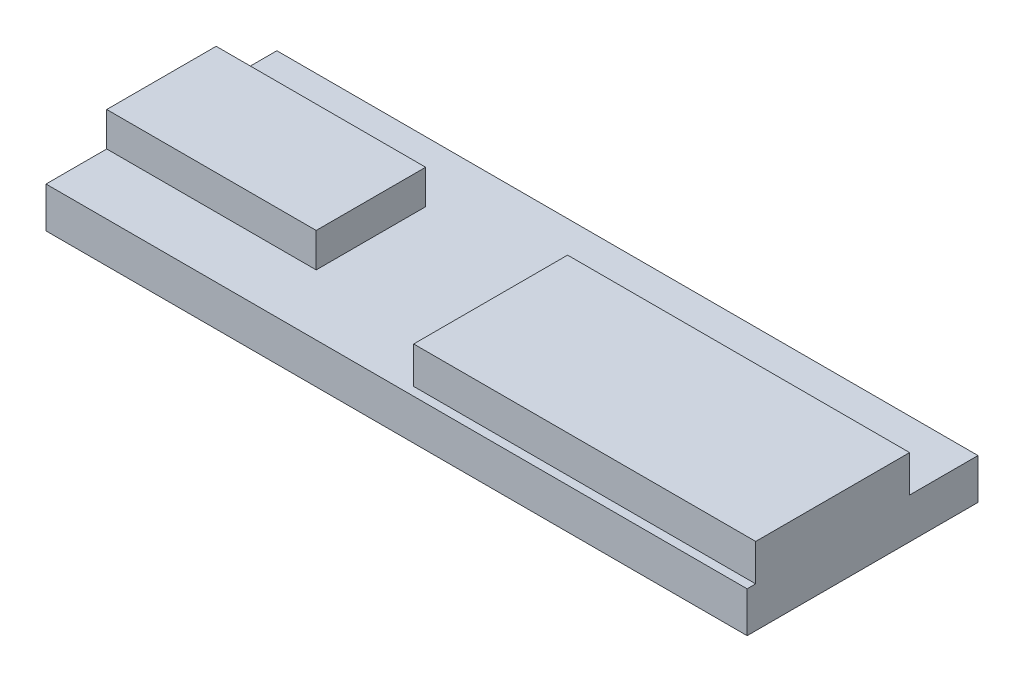
ISO-10303-21;
HEADER;
FILE_DESCRIPTION(('STEP AP214'),'2;1');
FILE_NAME('part.step','',(''),(''),'','','');
FILE_SCHEMA(('AUTOMOTIVE_DESIGN { 1 0 10303 214 1 1 1 1 }'));
ENDSEC;
DATA;
#1=APPLICATION_CONTEXT('core data for automotive mechanical design processes');
#2=APPLICATION_PROTOCOL_DEFINITION('international standard','automotive_design',2000,#1);
#3=PRODUCT_CONTEXT('',#1,'mechanical');
#4=PRODUCT('Part','Part','',(#3));
#5=PRODUCT_RELATED_PRODUCT_CATEGORY('part','',(#4));
#6=PRODUCT_DEFINITION_FORMATION('','',#4);
#7=PRODUCT_DEFINITION_CONTEXT('part definition',#1,'design');
#8=PRODUCT_DEFINITION('design','',#6,#7);
#9=PRODUCT_DEFINITION_SHAPE('','',#8);
#10=(LENGTH_UNIT() NAMED_UNIT(*) SI_UNIT(.MILLI.,.METRE.));
#11=(NAMED_UNIT(*) PLANE_ANGLE_UNIT() SI_UNIT($,.RADIAN.));
#12=(NAMED_UNIT(*) SI_UNIT($,.STERADIAN.) SOLID_ANGLE_UNIT());
#13=UNCERTAINTY_MEASURE_WITH_UNIT(LENGTH_MEASURE(1.E-05),#10,'distance_accuracy_value','');
#14=(GEOMETRIC_REPRESENTATION_CONTEXT(3) GLOBAL_UNCERTAINTY_ASSIGNED_CONTEXT((#13)) GLOBAL_UNIT_ASSIGNED_CONTEXT((#10,
#11,#12)) REPRESENTATION_CONTEXT('',''));
#15=CARTESIAN_POINT('',(0.,0.,0.));
#16=DIRECTION('',(0.,0.,1.));
#17=DIRECTION('',(1.,0.,0.));
#18=AXIS2_PLACEMENT_3D('',#15,#16,#17);
#19=CARTESIAN_POINT('',(0.,9.5,0.));
#20=DIRECTION('',(0.,-1.,0.));
#21=DIRECTION('',(0.,0.,-1.));
#22=AXIS2_PLACEMENT_3D('',#19,#20,#21);
#23=PLANE('',#22);
#24=DIRECTION('',(-1.,0.,0.));
#25=VECTOR('',#24,1.);
#26=CARTESIAN_POINT('',(164.,9.5,-38.));
#27=LINE('',#26,#25);
#28=CARTESIAN_POINT('',(164.,9.5,-38.));
#29=VERTEX_POINT('',#28);
#30=CARTESIAN_POINT('',(84.,9.5,-38.));
#31=VERTEX_POINT('',#30);
#32=EDGE_CURVE('E234',#29,#31,#27,.T.);
#33=ORIENTED_EDGE('',*,*,#32,.F.);
#34=DIRECTION('',(0.,0.,-1.));
#35=VECTOR('',#34,1.);
#36=CARTESIAN_POINT('',(164.,9.5,0.));
#37=LINE('',#36,#35);
#38=CARTESIAN_POINT('',(164.,9.5,-54.));
#39=VERTEX_POINT('',#38);
#40=EDGE_CURVE('E152',#29,#39,#37,.T.);
#41=ORIENTED_EDGE('',*,*,#40,.T.);
#42=DIRECTION('',(1.,0.,0.));
#43=VECTOR('',#42,1.);
#44=CARTESIAN_POINT('',(0.,9.5,-54.));
#45=LINE('',#44,#43);
#46=CARTESIAN_POINT('',(0.,9.5,-54.));
#47=VERTEX_POINT('',#46);
#48=EDGE_CURVE('E192',#47,#39,#45,.T.);
#49=ORIENTED_EDGE('',*,*,#48,.F.);
#50=DIRECTION('',(0.,0.,-1.));
#51=VECTOR('',#50,1.);
#52=CARTESIAN_POINT('',(0.,9.5,0.));
#53=LINE('',#52,#51);
#54=CARTESIAN_POINT('',(0.,9.5,-39.8));
#55=VERTEX_POINT('',#54);
#56=EDGE_CURVE('E193',#55,#47,#53,.T.);
#57=ORIENTED_EDGE('',*,*,#56,.F.);
#58=DIRECTION('',(-1.,0.,0.));
#59=VECTOR('',#58,1.);
#60=CARTESIAN_POINT('',(0.,9.5,-39.8));
#61=LINE('',#60,#59);
#62=CARTESIAN_POINT('',(49.,9.5,-39.8));
#63=VERTEX_POINT('',#62);
#64=EDGE_CURVE('E166',#63,#55,#61,.T.);
#65=ORIENTED_EDGE('',*,*,#64,.F.);
#66=DIRECTION('',(0.,0.,-1.));
#67=VECTOR('',#66,1.);
#68=CARTESIAN_POINT('',(49.,9.5,-14.2));
#69=LINE('',#68,#67);
#70=CARTESIAN_POINT('',(49.,9.5,-14.2));
#71=VERTEX_POINT('',#70);
#72=EDGE_CURVE('E156',#71,#63,#69,.T.);
#73=ORIENTED_EDGE('',*,*,#72,.F.);
#74=DIRECTION('',(1.,0.,0.));
#75=VECTOR('',#74,1.);
#76=CARTESIAN_POINT('',(0.,9.5,-14.2));
#77=LINE('',#76,#75);
#78=CARTESIAN_POINT('',(0.,9.5,-14.2));
#79=VERTEX_POINT('',#78);
#80=EDGE_CURVE('E153',#79,#71,#77,.T.);
#81=ORIENTED_EDGE('',*,*,#80,.F.);
#82=CARTESIAN_POINT('',(0.,9.5,0.));
#83=VERTEX_POINT('',#82);
#84=EDGE_CURVE('E189',#83,#79,#53,.T.);
#85=ORIENTED_EDGE('',*,*,#84,.F.);
#86=DIRECTION('',(1.,0.,0.));
#87=VECTOR('',#86,1.);
#88=CARTESIAN_POINT('',(0.,9.5,0.));
#89=LINE('',#88,#87);
#90=CARTESIAN_POINT('',(164.,9.5,0.));
#91=VERTEX_POINT('',#90);
#92=EDGE_CURVE('E198',#83,#91,#89,.T.);
#93=ORIENTED_EDGE('',*,*,#92,.T.);
#94=CARTESIAN_POINT('',(164.,9.5,-1.99999999999999));
#95=VERTEX_POINT('',#94);
#96=EDGE_CURVE('E196',#91,#95,#37,.T.);
#97=ORIENTED_EDGE('',*,*,#96,.T.);
#98=DIRECTION('',(1.,0.,0.));
#99=VECTOR('',#98,1.);
#100=CARTESIAN_POINT('',(164.,9.5,-2.));
#101=LINE('',#100,#99);
#102=CARTESIAN_POINT('',(84.,9.5,-1.99999999999999));
#103=VERTEX_POINT('',#102);
#104=EDGE_CURVE('E62',#103,#95,#101,.T.);
#105=ORIENTED_EDGE('',*,*,#104,.F.);
#106=DIRECTION('',(0.,0.,1.));
#107=VECTOR('',#106,1.);
#108=CARTESIAN_POINT('',(84.,9.5,-1.99999999999999));
#109=LINE('',#108,#107);
#110=EDGE_CURVE('E57',#31,#103,#109,.T.);
#111=ORIENTED_EDGE('',*,*,#110,.F.);
#112=EDGE_LOOP('',(#33,#41,#49,#57,#65,#73,#81,#85,#93,#97,#105,#111));
#113=FACE_BOUND('',#112,.T.);
#114=ADVANCED_FACE('F40',(#113),#23,.F.);
#115=CARTESIAN_POINT('',(0.,9.5,0.));
#116=DIRECTION('',(-1.,0.,0.));
#117=DIRECTION('',(0.,0.,1.));
#118=AXIS2_PLACEMENT_3D('',#115,#116,#117);
#119=PLANE('',#118);
#120=DIRECTION('',(0.,0.,-1.));
#121=VECTOR('',#120,1.);
#122=CARTESIAN_POINT('',(0.,0.,0.));
#123=LINE('',#122,#121);
#124=CARTESIAN_POINT('',(0.,0.,0.));
#125=VERTEX_POINT('',#124);
#126=CARTESIAN_POINT('',(0.,0.,-54.));
#127=VERTEX_POINT('',#126);
#128=EDGE_CURVE('E188',#125,#127,#123,.T.);
#129=ORIENTED_EDGE('',*,*,#128,.F.);
#130=DIRECTION('',(0.,-1.,0.));
#131=VECTOR('',#130,1.);
#132=CARTESIAN_POINT('',(0.,9.5,0.));
#133=LINE('',#132,#131);
#134=EDGE_CURVE('E11',#83,#125,#133,.T.);
#135=ORIENTED_EDGE('',*,*,#134,.F.);
#136=ORIENTED_EDGE('',*,*,#84,.T.);
#137=DIRECTION('',(0.,-1.,0.));
#138=VECTOR('',#137,1.);
#139=CARTESIAN_POINT('',(0.,17.5,-14.2));
#140=LINE('',#139,#138);
#141=CARTESIAN_POINT('',(0.,17.5,-14.2));
#142=VERTEX_POINT('',#141);
#143=EDGE_CURVE('E185',#142,#79,#140,.T.);
#144=ORIENTED_EDGE('',*,*,#143,.F.);
#145=DIRECTION('',(0.,0.,1.));
#146=VECTOR('',#145,1.);
#147=CARTESIAN_POINT('',(0.,17.5,-14.2));
#148=LINE('',#147,#146);
#149=CARTESIAN_POINT('',(0.,17.5,-39.8));
#150=VERTEX_POINT('',#149);
#151=EDGE_CURVE('E162',#150,#142,#148,.T.);
#152=ORIENTED_EDGE('',*,*,#151,.F.);
#153=DIRECTION('',(0.,-1.,0.));
#154=VECTOR('',#153,1.);
#155=CARTESIAN_POINT('',(0.,17.5,-39.8));
#156=LINE('',#155,#154);
#157=EDGE_CURVE('E171',#150,#55,#156,.T.);
#158=ORIENTED_EDGE('',*,*,#157,.T.);
#159=ORIENTED_EDGE('',*,*,#56,.T.);
#160=DIRECTION('',(0.,-1.,0.));
#161=VECTOR('',#160,1.);
#162=CARTESIAN_POINT('',(0.,9.5,-54.));
#163=LINE('',#162,#161);
#164=EDGE_CURVE('E44',#47,#127,#163,.T.);
#165=ORIENTED_EDGE('',*,*,#164,.T.);
#166=EDGE_LOOP('',(#129,#135,#136,#144,#152,#158,#159,#165));
#167=FACE_BOUND('',#166,.T.);
#168=ADVANCED_FACE('F42',(#167),#119,.T.);
#169=CARTESIAN_POINT('',(0.,9.5,0.));
#170=DIRECTION('',(0.,0.,-1.));
#171=DIRECTION('',(-1.,0.,0.));
#172=AXIS2_PLACEMENT_3D('',#169,#170,#171);
#173=PLANE('',#172);
#174=DIRECTION('',(1.,0.,0.));
#175=VECTOR('',#174,1.);
#176=CARTESIAN_POINT('',(0.,0.,0.));
#177=LINE('',#176,#175);
#178=CARTESIAN_POINT('',(164.,0.,0.));
#179=VERTEX_POINT('',#178);
#180=EDGE_CURVE('E207',#125,#179,#177,.T.);
#181=ORIENTED_EDGE('',*,*,#180,.T.);
#182=DIRECTION('',(0.,-1.,0.));
#183=VECTOR('',#182,1.);
#184=CARTESIAN_POINT('',(164.,9.5,0.));
#185=LINE('',#184,#183);
#186=EDGE_CURVE('E49',#91,#179,#185,.T.);
#187=ORIENTED_EDGE('',*,*,#186,.F.);
#188=ORIENTED_EDGE('',*,*,#92,.F.);
#189=ORIENTED_EDGE('',*,*,#134,.T.);
#190=EDGE_LOOP('',(#181,#187,#188,#189));
#191=FACE_BOUND('',#190,.T.);
#192=ADVANCED_FACE('F224',(#191),#173,.F.);
#193=CARTESIAN_POINT('',(164.,9.5,0.));
#194=DIRECTION('',(-1.,0.,0.));
#195=DIRECTION('',(0.,0.,1.));
#196=AXIS2_PLACEMENT_3D('',#193,#194,#195);
#197=PLANE('',#196);
#198=DIRECTION('',(0.,0.,-1.));
#199=VECTOR('',#198,1.);
#200=CARTESIAN_POINT('',(164.,0.,0.));
#201=LINE('',#200,#199);
#202=CARTESIAN_POINT('',(164.,0.,-54.));
#203=VERTEX_POINT('',#202);
#204=EDGE_CURVE('E205',#179,#203,#201,.T.);
#205=ORIENTED_EDGE('',*,*,#204,.T.);
#206=DIRECTION('',(0.,-1.,0.));
#207=VECTOR('',#206,1.);
#208=CARTESIAN_POINT('',(164.,9.5,-54.));
#209=LINE('',#208,#207);
#210=EDGE_CURVE('E210',#39,#203,#209,.T.);
#211=ORIENTED_EDGE('',*,*,#210,.F.);
#212=ORIENTED_EDGE('',*,*,#40,.F.);
#213=DIRECTION('',(0.,-1.,0.));
#214=VECTOR('',#213,1.);
#215=CARTESIAN_POINT('',(164.,18.1,-38.));
#216=LINE('',#215,#214);
#217=CARTESIAN_POINT('',(164.,18.1,-38.));
#218=VERTEX_POINT('',#217);
#219=EDGE_CURVE('E133',#218,#29,#216,.T.);
#220=ORIENTED_EDGE('',*,*,#219,.F.);
#221=DIRECTION('',(0.,0.,-1.));
#222=VECTOR('',#221,1.);
#223=CARTESIAN_POINT('',(164.,18.1,-2.));
#224=LINE('',#223,#222);
#225=CARTESIAN_POINT('',(164.,18.1,-2.));
#226=VERTEX_POINT('',#225);
#227=EDGE_CURVE('E139',#226,#218,#224,.T.);
#228=ORIENTED_EDGE('',*,*,#227,.F.);
#229=DIRECTION('',(0.,-1.,0.));
#230=VECTOR('',#229,1.);
#231=CARTESIAN_POINT('',(164.,18.1,-2.));
#232=LINE('',#231,#230);
#233=EDGE_CURVE('E227',#226,#95,#232,.T.);
#234=ORIENTED_EDGE('',*,*,#233,.T.);
#235=ORIENTED_EDGE('',*,*,#96,.F.);
#236=ORIENTED_EDGE('',*,*,#186,.T.);
#237=EDGE_LOOP('',(#205,#211,#212,#220,#228,#234,#235,#236));
#238=FACE_BOUND('',#237,.T.);
#239=ADVANCED_FACE('F150',(#238),#197,.F.);
#240=CARTESIAN_POINT('',(0.,9.5,-54.));
#241=DIRECTION('',(0.,0.,-1.));
#242=DIRECTION('',(-1.,0.,0.));
#243=AXIS2_PLACEMENT_3D('',#240,#241,#242);
#244=PLANE('',#243);
#245=DIRECTION('',(1.,0.,0.));
#246=VECTOR('',#245,1.);
#247=CARTESIAN_POINT('',(0.,0.,-54.));
#248=LINE('',#247,#246);
#249=EDGE_CURVE('E202',#127,#203,#248,.T.);
#250=ORIENTED_EDGE('',*,*,#249,.F.);
#251=ORIENTED_EDGE('',*,*,#164,.F.);
#252=ORIENTED_EDGE('',*,*,#48,.T.);
#253=ORIENTED_EDGE('',*,*,#210,.T.);
#254=EDGE_LOOP('',(#250,#251,#252,#253));
#255=FACE_BOUND('',#254,.T.);
#256=ADVANCED_FACE('F217',(#255),#244,.T.);
#257=CARTESIAN_POINT('',(0.,0.,0.));
#258=DIRECTION('',(0.,-1.,0.));
#259=DIRECTION('',(0.,0.,-1.));
#260=AXIS2_PLACEMENT_3D('',#257,#258,#259);
#261=PLANE('',#260);
#262=ORIENTED_EDGE('',*,*,#128,.T.);
#263=ORIENTED_EDGE('',*,*,#249,.T.);
#264=ORIENTED_EDGE('',*,*,#204,.F.);
#265=ORIENTED_EDGE('',*,*,#180,.F.);
#266=EDGE_LOOP('',(#262,#263,#264,#265));
#267=FACE_BOUND('',#266,.T.);
#268=ADVANCED_FACE('F221',(#267),#261,.T.);
#269=CARTESIAN_POINT('',(0.,17.5,-14.2));
#270=DIRECTION('',(0.,0.,-1.));
#271=DIRECTION('',(-1.,0.,0.));
#272=AXIS2_PLACEMENT_3D('',#269,#270,#271);
#273=PLANE('',#272);
#274=ORIENTED_EDGE('',*,*,#80,.T.);
#275=DIRECTION('',(0.,-1.,0.));
#276=VECTOR('',#275,1.);
#277=CARTESIAN_POINT('',(49.,17.5,-14.2));
#278=LINE('',#277,#276);
#279=CARTESIAN_POINT('',(49.,17.5,-14.2));
#280=VERTEX_POINT('',#279);
#281=EDGE_CURVE('E182',#280,#71,#278,.T.);
#282=ORIENTED_EDGE('',*,*,#281,.F.);
#283=DIRECTION('',(1.,0.,0.));
#284=VECTOR('',#283,1.);
#285=CARTESIAN_POINT('',(0.,17.5,-14.2));
#286=LINE('',#285,#284);
#287=EDGE_CURVE('E165',#142,#280,#286,.T.);
#288=ORIENTED_EDGE('',*,*,#287,.F.);
#289=ORIENTED_EDGE('',*,*,#143,.T.);
#290=EDGE_LOOP('',(#274,#282,#288,#289));
#291=FACE_BOUND('',#290,.T.);
#292=ADVANCED_FACE('F258',(#291),#273,.F.);
#293=CARTESIAN_POINT('',(49.,17.5,-14.2));
#294=DIRECTION('',(-1.,0.,0.));
#295=DIRECTION('',(0.,0.,1.));
#296=AXIS2_PLACEMENT_3D('',#293,#294,#295);
#297=PLANE('',#296);
#298=ORIENTED_EDGE('',*,*,#72,.T.);
#299=DIRECTION('',(0.,-1.,0.));
#300=VECTOR('',#299,1.);
#301=CARTESIAN_POINT('',(49.,17.5,-39.8));
#302=LINE('',#301,#300);
#303=CARTESIAN_POINT('',(49.,17.5,-39.8));
#304=VERTEX_POINT('',#303);
#305=EDGE_CURVE('E179',#304,#63,#302,.T.);
#306=ORIENTED_EDGE('',*,*,#305,.F.);
#307=DIRECTION('',(0.,0.,-1.));
#308=VECTOR('',#307,1.);
#309=CARTESIAN_POINT('',(49.,17.5,-14.2));
#310=LINE('',#309,#308);
#311=EDGE_CURVE('E168',#280,#304,#310,.T.);
#312=ORIENTED_EDGE('',*,*,#311,.F.);
#313=ORIENTED_EDGE('',*,*,#281,.T.);
#314=EDGE_LOOP('',(#298,#306,#312,#313));
#315=FACE_BOUND('',#314,.T.);
#316=ADVANCED_FACE('F282',(#315),#297,.F.);
#317=CARTESIAN_POINT('',(0.,17.5,-39.8));
#318=DIRECTION('',(0.,0.,1.));
#319=DIRECTION('',(1.,0.,0.));
#320=AXIS2_PLACEMENT_3D('',#317,#318,#319);
#321=PLANE('',#320);
#322=ORIENTED_EDGE('',*,*,#64,.T.);
#323=ORIENTED_EDGE('',*,*,#157,.F.);
#324=DIRECTION('',(-1.,0.,0.));
#325=VECTOR('',#324,1.);
#326=CARTESIAN_POINT('',(0.,17.5,-39.8));
#327=LINE('',#326,#325);
#328=EDGE_CURVE('E170',#304,#150,#327,.T.);
#329=ORIENTED_EDGE('',*,*,#328,.F.);
#330=ORIENTED_EDGE('',*,*,#305,.T.);
#331=EDGE_LOOP('',(#322,#323,#329,#330));
#332=FACE_BOUND('',#331,.T.);
#333=ADVANCED_FACE('F289',(#332),#321,.F.);
#334=CARTESIAN_POINT('',(0.,17.5,0.));
#335=DIRECTION('',(0.,-1.,0.));
#336=DIRECTION('',(0.,0.,-1.));
#337=AXIS2_PLACEMENT_3D('',#334,#335,#336);
#338=PLANE('',#337);
#339=ORIENTED_EDGE('',*,*,#151,.T.);
#340=ORIENTED_EDGE('',*,*,#287,.T.);
#341=ORIENTED_EDGE('',*,*,#311,.T.);
#342=ORIENTED_EDGE('',*,*,#328,.T.);
#343=EDGE_LOOP('',(#339,#340,#341,#342));
#344=FACE_BOUND('',#343,.T.);
#345=ADVANCED_FACE('F249',(#344),#338,.F.);
#346=CARTESIAN_POINT('',(164.,18.1,-38.));
#347=DIRECTION('',(0.,0.,1.));
#348=DIRECTION('',(1.,0.,0.));
#349=AXIS2_PLACEMENT_3D('',#346,#347,#348);
#350=PLANE('',#349);
#351=ORIENTED_EDGE('',*,*,#32,.T.);
#352=DIRECTION('',(0.,-1.,0.));
#353=VECTOR('',#352,1.);
#354=CARTESIAN_POINT('',(84.,18.1,-38.));
#355=LINE('',#354,#353);
#356=CARTESIAN_POINT('',(84.,18.1,-38.));
#357=VERTEX_POINT('',#356);
#358=EDGE_CURVE('E135',#357,#31,#355,.T.);
#359=ORIENTED_EDGE('',*,*,#358,.F.);
#360=DIRECTION('',(-1.,0.,0.));
#361=VECTOR('',#360,1.);
#362=CARTESIAN_POINT('',(164.,18.1,-38.));
#363=LINE('',#362,#361);
#364=EDGE_CURVE('E129',#218,#357,#363,.T.);
#365=ORIENTED_EDGE('',*,*,#364,.F.);
#366=ORIENTED_EDGE('',*,*,#219,.T.);
#367=EDGE_LOOP('',(#351,#359,#365,#366));
#368=FACE_BOUND('',#367,.T.);
#369=ADVANCED_FACE('F131',(#368),#350,.F.);
#370=CARTESIAN_POINT('',(84.,18.1,-1.99999999999999));
#371=DIRECTION('',(1.,0.,0.));
#372=DIRECTION('',(0.,0.,-1.));
#373=AXIS2_PLACEMENT_3D('',#370,#371,#372);
#374=PLANE('',#373);
#375=ORIENTED_EDGE('',*,*,#110,.T.);
#376=DIRECTION('',(0.,-1.,0.));
#377=VECTOR('',#376,1.);
#378=CARTESIAN_POINT('',(84.,18.1,-1.99999999999999));
#379=LINE('',#378,#377);
#380=CARTESIAN_POINT('',(84.,18.1,-1.99999999999999));
#381=VERTEX_POINT('',#380);
#382=EDGE_CURVE('E158',#381,#103,#379,.T.);
#383=ORIENTED_EDGE('',*,*,#382,.F.);
#384=DIRECTION('',(0.,0.,1.));
#385=VECTOR('',#384,1.);
#386=CARTESIAN_POINT('',(84.,18.1,-1.99999999999999));
#387=LINE('',#386,#385);
#388=EDGE_CURVE('E138',#357,#381,#387,.T.);
#389=ORIENTED_EDGE('',*,*,#388,.F.);
#390=ORIENTED_EDGE('',*,*,#358,.T.);
#391=EDGE_LOOP('',(#375,#383,#389,#390));
#392=FACE_BOUND('',#391,.T.);
#393=ADVANCED_FACE('F241',(#392),#374,.F.);
#394=CARTESIAN_POINT('',(164.,18.1,-2.));
#395=DIRECTION('',(0.,0.,-1.));
#396=DIRECTION('',(-1.,0.,0.));
#397=AXIS2_PLACEMENT_3D('',#394,#395,#396);
#398=PLANE('',#397);
#399=ORIENTED_EDGE('',*,*,#104,.T.);
#400=ORIENTED_EDGE('',*,*,#233,.F.);
#401=DIRECTION('',(1.,0.,0.));
#402=VECTOR('',#401,1.);
#403=CARTESIAN_POINT('',(164.,18.1,-2.));
#404=LINE('',#403,#402);
#405=EDGE_CURVE('E144',#381,#226,#404,.T.);
#406=ORIENTED_EDGE('',*,*,#405,.F.);
#407=ORIENTED_EDGE('',*,*,#382,.T.);
#408=EDGE_LOOP('',(#399,#400,#406,#407));
#409=FACE_BOUND('',#408,.T.);
#410=ADVANCED_FACE('F231',(#409),#398,.F.);
#411=CARTESIAN_POINT('',(0.,18.1,0.));
#412=DIRECTION('',(0.,1.,0.));
#413=DIRECTION('',(0.,0.,1.));
#414=AXIS2_PLACEMENT_3D('',#411,#412,#413);
#415=PLANE('',#414);
#416=ORIENTED_EDGE('',*,*,#227,.T.);
#417=ORIENTED_EDGE('',*,*,#364,.T.);
#418=ORIENTED_EDGE('',*,*,#388,.T.);
#419=ORIENTED_EDGE('',*,*,#405,.T.);
#420=EDGE_LOOP('',(#416,#417,#418,#419));
#421=FACE_BOUND('',#420,.T.);
#422=ADVANCED_FACE('F142',(#421),#415,.T.);
#423=CLOSED_SHELL('',(#114,#168,#192,#239,#256,#268,#292,#316,#333,#345,#369,#393,#410,#422));
#424=MANIFOLD_SOLID_BREP('B2',#423);
#425=ADVANCED_BREP_SHAPE_REPRESENTATION('',(#18,#424),#14);
#426=SHAPE_DEFINITION_REPRESENTATION(#9,#425);
ENDSEC;
END-ISO-10303-21;
